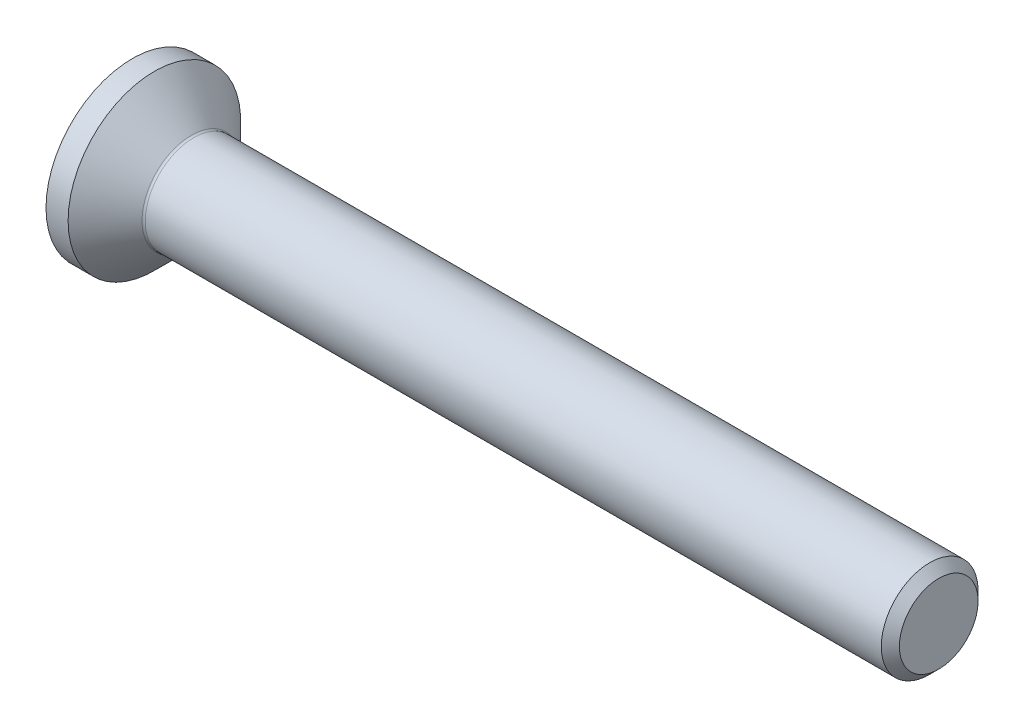
ISO-10303-21;
HEADER;
FILE_DESCRIPTION(('STEP AP214'),'2;1');
FILE_NAME('part.step','',(''),(''),'','','');
FILE_SCHEMA(('AUTOMOTIVE_DESIGN { 1 0 10303 214 1 1 1 1 }'));
ENDSEC;
DATA;
#1=APPLICATION_CONTEXT('core data for automotive mechanical design processes');
#2=APPLICATION_PROTOCOL_DEFINITION('international standard','automotive_design',2000,#1);
#3=PRODUCT_CONTEXT('',#1,'mechanical');
#4=PRODUCT('Part','Part','',(#3));
#5=PRODUCT_RELATED_PRODUCT_CATEGORY('part','',(#4));
#6=PRODUCT_DEFINITION_FORMATION('','',#4);
#7=PRODUCT_DEFINITION_CONTEXT('part definition',#1,'design');
#8=PRODUCT_DEFINITION('design','',#6,#7);
#9=PRODUCT_DEFINITION_SHAPE('','',#8);
#10=(LENGTH_UNIT() NAMED_UNIT(*) SI_UNIT(.MILLI.,.METRE.));
#11=(NAMED_UNIT(*) PLANE_ANGLE_UNIT() SI_UNIT($,.RADIAN.));
#12=(NAMED_UNIT(*) SI_UNIT($,.STERADIAN.) SOLID_ANGLE_UNIT());
#13=UNCERTAINTY_MEASURE_WITH_UNIT(LENGTH_MEASURE(1.E-05),#10,'distance_accuracy_value','');
#14=(GEOMETRIC_REPRESENTATION_CONTEXT(3) GLOBAL_UNCERTAINTY_ASSIGNED_CONTEXT((#13)) GLOBAL_UNIT_ASSIGNED_CONTEXT((#10,
#11,#12)) REPRESENTATION_CONTEXT('',''));
#15=CARTESIAN_POINT('',(0.,0.,0.));
#16=DIRECTION('',(0.,0.,1.));
#17=DIRECTION('',(1.,0.,0.));
#18=AXIS2_PLACEMENT_3D('',#15,#16,#17);
#19=CARTESIAN_POINT('',(0.,0.,0.));
#20=DIRECTION('',(-1.,0.,0.));
#21=DIRECTION('',(0.,0.,1.));
#22=AXIS2_PLACEMENT_3D('',#19,#20,#21);
#23=PLANE('',#22);
#24=CARTESIAN_POINT('',(0.,0.,0.));
#25=DIRECTION('',(-1.,0.,0.));
#26=DIRECTION('',(0.,0.,1.));
#27=AXIS2_PLACEMENT_3D('',#24,#25,#26);
#28=CIRCLE('',#27,2.675);
#29=CARTESIAN_POINT('',(0.,0.,2.675));
#30=VERTEX_POINT('',#29);
#31=EDGE_CURVE('E145',#30,#30,#28,.T.);
#32=ORIENTED_EDGE('',*,*,#31,.T.);
#33=EDGE_LOOP('',(#32));
#34=FACE_BOUND('',#33,.T.);
#35=DIRECTION('',(0.,-0.499999999999998,-0.86602540378444));
#36=VECTOR('',#35,1.);
#37=CARTESIAN_POINT('',(0.,-0.577350269189626,1.));
#38=LINE('',#37,#36);
#39=CARTESIAN_POINT('',(0.,-0.577350269189626,1.));
#40=VERTEX_POINT('',#39);
#41=CARTESIAN_POINT('',(0.,-1.15470053837925,0.));
#42=VERTEX_POINT('',#41);
#43=EDGE_CURVE('E121',#40,#42,#38,.T.);
#44=ORIENTED_EDGE('',*,*,#43,.T.);
#45=DIRECTION('',(0.,0.499999999999999,-0.866025403784439));
#46=VECTOR('',#45,1.);
#47=CARTESIAN_POINT('',(0.,-1.15470053837925,0.));
#48=LINE('',#47,#46);
#49=CARTESIAN_POINT('',(0.,-0.577350269189625,-1.));
#50=VERTEX_POINT('',#49);
#51=EDGE_CURVE('E52',#42,#50,#48,.T.);
#52=ORIENTED_EDGE('',*,*,#51,.T.);
#53=DIRECTION('',(0.,1.,0.));
#54=VECTOR('',#53,1.);
#55=CARTESIAN_POINT('',(0.,-0.577350269189625,-1.));
#56=LINE('',#55,#54);
#57=CARTESIAN_POINT('',(0.,0.577350269189626,-1.));
#58=VERTEX_POINT('',#57);
#59=EDGE_CURVE('E132',#50,#58,#56,.T.);
#60=ORIENTED_EDGE('',*,*,#59,.T.);
#61=DIRECTION('',(0.,0.5,0.866025403784439));
#62=VECTOR('',#61,1.);
#63=CARTESIAN_POINT('',(0.,0.577350269189626,-1.));
#64=LINE('',#63,#62);
#65=CARTESIAN_POINT('',(0.,1.15470053837925,0.));
#66=VERTEX_POINT('',#65);
#67=EDGE_CURVE('E380',#58,#66,#64,.T.);
#68=ORIENTED_EDGE('',*,*,#67,.T.);
#69=DIRECTION('',(0.,-0.499999999999999,0.866025403784439));
#70=VECTOR('',#69,1.);
#71=CARTESIAN_POINT('',(0.,1.15470053837925,0.));
#72=LINE('',#71,#70);
#73=CARTESIAN_POINT('',(0.,0.577350269189626,0.999999999999999));
#74=VERTEX_POINT('',#73);
#75=EDGE_CURVE('E383',#66,#74,#72,.T.);
#76=ORIENTED_EDGE('',*,*,#75,.T.);
#77=DIRECTION('',(0.,-1.,0.));
#78=VECTOR('',#77,1.);
#79=CARTESIAN_POINT('',(0.,0.577350269189626,0.999999999999999));
#80=LINE('',#79,#78);
#81=EDGE_CURVE('E386',#74,#40,#80,.T.);
#82=ORIENTED_EDGE('',*,*,#81,.T.);
#83=EDGE_LOOP('',(#44,#52,#60,#68,#76,#82));
#84=FACE_BOUND('',#83,.T.);
#85=ADVANCED_FACE('F37',(#34,#84),#23,.T.);
#86=CARTESIAN_POINT('',(25.,1.2195,0.));
#87=DIRECTION('',(1.,0.,0.));
#88=DIRECTION('',(0.,0.,-1.));
#89=AXIS2_PLACEMENT_3D('',#86,#87,#88);
#90=PLANE('',#89);
#91=CARTESIAN_POINT('',(25.,0.,0.));
#92=DIRECTION('',(-1.,0.,0.));
#93=DIRECTION('',(0.,0.,1.));
#94=AXIS2_PLACEMENT_3D('',#91,#92,#93);
#95=CIRCLE('',#94,1.2195);
#96=CARTESIAN_POINT('',(25.,0.,1.2195));
#97=VERTEX_POINT('',#96);
#98=EDGE_CURVE('E155',#97,#97,#95,.T.);
#99=ORIENTED_EDGE('',*,*,#98,.F.);
#100=EDGE_LOOP('',(#99));
#101=FACE_BOUND('',#100,.T.);
#102=ADVANCED_FACE('F175',(#101),#90,.T.);
#103=CARTESIAN_POINT('',(25.,0.,0.));
#104=DIRECTION('',(-1.,0.,0.));
#105=DIRECTION('',(0.,0.,1.));
#106=AXIS2_PLACEMENT_3D('',#103,#104,#105);
#107=CONICAL_SURFACE('',#106,1.2195,0.785398163397374);
#108=CARTESIAN_POINT('',(24.7195,0.,0.));
#109=DIRECTION('',(-1.,0.,0.));
#110=DIRECTION('',(0.,0.,1.));
#111=AXIS2_PLACEMENT_3D('',#108,#109,#110);
#112=CIRCLE('',#111,1.49999999999997);
#113=CARTESIAN_POINT('',(24.7195,0.,1.49999999999997));
#114=VERTEX_POINT('',#113);
#115=EDGE_CURVE('E152',#114,#114,#112,.T.);
#116=ORIENTED_EDGE('',*,*,#115,.F.);
#117=EDGE_LOOP('',(#116));
#118=FACE_BOUND('',#117,.T.);
#119=ORIENTED_EDGE('',*,*,#98,.T.);
#120=EDGE_LOOP('',(#119));
#121=FACE_BOUND('',#120,.T.);
#122=ADVANCED_FACE('F181',(#118,#121),#107,.T.);
#123=CARTESIAN_POINT('',(0.,0.,0.));
#124=DIRECTION('',(-1.,0.,0.));
#125=DIRECTION('',(0.,0.,1.));
#126=AXIS2_PLACEMENT_3D('',#123,#124,#125);
#127=CYLINDRICAL_SURFACE('',#126,1.49999999999999);
#128=CARTESIAN_POINT('',(1.90142135623733,0.,0.));
#129=DIRECTION('',(-1.,0.,0.));
#130=DIRECTION('',(0.,0.,1.));
#131=AXIS2_PLACEMENT_3D('',#128,#129,#130);
#132=CIRCLE('',#131,1.49999999999999);
#133=CARTESIAN_POINT('',(1.90142135623733,0.,1.49999999999999));
#134=VERTEX_POINT('',#133);
#135=EDGE_CURVE('E11',#134,#134,#132,.F.);
#136=ORIENTED_EDGE('',*,*,#135,.T.);
#137=EDGE_LOOP('',(#136));
#138=FACE_BOUND('',#137,.T.);
#139=ORIENTED_EDGE('',*,*,#115,.T.);
#140=EDGE_LOOP('',(#139));
#141=FACE_BOUND('',#140,.T.);
#142=ADVANCED_FACE('F189',(#138,#141),#127,.T.);
#143=CARTESIAN_POINT('',(0.685000000000012,0.,0.));
#144=DIRECTION('',(-1.,0.,0.));
#145=DIRECTION('',(0.,0.,1.));
#146=AXIS2_PLACEMENT_3D('',#143,#144,#145);
#147=CONICAL_SURFACE('',#146,2.675,0.785398163397451);
#148=CARTESIAN_POINT('',(1.83071067811867,0.,0.));
#149=DIRECTION('',(-1.,0.,0.));
#150=DIRECTION('',(0.,0.,1.));
#151=AXIS2_PLACEMENT_3D('',#148,#149,#150);
#152=CIRCLE('',#151,1.52928932188133);
#153=CARTESIAN_POINT('',(1.83071067811867,0.,1.52928932188133));
#154=VERTEX_POINT('',#153);
#155=EDGE_CURVE('E45',#154,#154,#152,.T.);
#156=ORIENTED_EDGE('',*,*,#155,.T.);
#157=EDGE_LOOP('',(#156));
#158=FACE_BOUND('',#157,.T.);
#159=CARTESIAN_POINT('',(0.685000000000012,0.,0.));
#160=DIRECTION('',(-1.,0.,0.));
#161=DIRECTION('',(0.,0.,1.));
#162=AXIS2_PLACEMENT_3D('',#159,#160,#161);
#163=CIRCLE('',#162,2.675);
#164=CARTESIAN_POINT('',(0.685000000000012,0.,2.675));
#165=VERTEX_POINT('',#164);
#166=EDGE_CURVE('E149',#165,#165,#163,.T.);
#167=ORIENTED_EDGE('',*,*,#166,.F.);
#168=EDGE_LOOP('',(#167));
#169=FACE_BOUND('',#168,.T.);
#170=ADVANCED_FACE('F160',(#158,#169),#147,.T.);
#171=CARTESIAN_POINT('',(0.,0.,0.));
#172=DIRECTION('',(-1.,0.,0.));
#173=DIRECTION('',(0.,0.,1.));
#174=AXIS2_PLACEMENT_3D('',#171,#172,#173);
#175=CYLINDRICAL_SURFACE('',#174,2.675);
#176=ORIENTED_EDGE('',*,*,#166,.T.);
#177=EDGE_LOOP('',(#176));
#178=FACE_BOUND('',#177,.T.);
#179=ORIENTED_EDGE('',*,*,#31,.F.);
#180=EDGE_LOOP('',(#179));
#181=FACE_BOUND('',#180,.T.);
#182=ADVANCED_FACE('F164',(#178,#181),#175,.T.);
#183=CARTESIAN_POINT('',(1.90142135623733,0.,0.));
#184=DIRECTION('',(-1.,0.,0.));
#185=DIRECTION('',(0.,0.,1.));
#186=AXIS2_PLACEMENT_3D('',#183,#184,#185);
#187=TOROIDAL_SURFACE('',#186,1.59999999999999,0.1);
#188=ORIENTED_EDGE('',*,*,#135,.F.);
#189=EDGE_LOOP('',(#188));
#190=FACE_BOUND('',#189,.T.);
#191=ORIENTED_EDGE('',*,*,#155,.F.);
#192=EDGE_LOOP('',(#191));
#193=FACE_BOUND('',#192,.T.);
#194=ADVANCED_FACE('F39',(#190,#193),#187,.F.);
#195=CARTESIAN_POINT('',(1.1,-1.15470053837925,0.));
#196=DIRECTION('',(0.,0.866025403784439,0.499999999999999));
#197=DIRECTION('',(0.,-0.499999999999999,0.866025403784439));
#198=AXIS2_PLACEMENT_3D('',#195,#196,#197);
#199=PLANE('',#198);
#200=ORIENTED_EDGE('',*,*,#51,.F.);
#201=DIRECTION('',(-1.,0.,0.));
#202=VECTOR('',#201,1.);
#203=CARTESIAN_POINT('',(1.1,-1.15470053837925,0.));
#204=LINE('',#203,#202);
#205=CARTESIAN_POINT('',(1.1,-1.15470053837925,0.));
#206=VERTEX_POINT('',#205);
#207=EDGE_CURVE('E377',#206,#42,#204,.T.);
#208=ORIENTED_EDGE('',*,*,#207,.F.);
#209=DIRECTION('',(0.,0.499999999999999,-0.866025403784439));
#210=VECTOR('',#209,1.);
#211=CARTESIAN_POINT('',(1.1,-1.15470053837925,0.));
#212=LINE('',#211,#210);
#213=CARTESIAN_POINT('',(1.1,-0.866025403784438,-0.499999999999998));
#214=VERTEX_POINT('',#213);
#215=EDGE_CURVE('E117',#206,#214,#212,.T.);
#216=ORIENTED_EDGE('',*,*,#215,.T.);
#217=CARTESIAN_POINT('',(1.1,-0.577350269189625,-1.));
#218=VERTEX_POINT('',#217);
#219=EDGE_CURVE('E113',#214,#218,#212,.T.);
#220=ORIENTED_EDGE('',*,*,#219,.T.);
#221=DIRECTION('',(-1.,0.,0.));
#222=VECTOR('',#221,1.);
#223=CARTESIAN_POINT('',(1.1,-0.577350269189625,-1.));
#224=LINE('',#223,#222);
#225=EDGE_CURVE('E115',#218,#50,#224,.T.);
#226=ORIENTED_EDGE('',*,*,#225,.T.);
#227=EDGE_LOOP('',(#200,#208,#216,#220,#226));
#228=FACE_BOUND('',#227,.T.);
#229=ADVANCED_FACE('F114',(#228),#199,.T.);
#230=CARTESIAN_POINT('',(1.1,-0.577350269189625,-1.));
#231=DIRECTION('',(0.,0.,1.));
#232=DIRECTION('',(1.,0.,0.));
#233=AXIS2_PLACEMENT_3D('',#230,#231,#232);
#234=PLANE('',#233);
#235=ORIENTED_EDGE('',*,*,#59,.F.);
#236=ORIENTED_EDGE('',*,*,#225,.F.);
#237=DIRECTION('',(0.,1.,0.));
#238=VECTOR('',#237,1.);
#239=CARTESIAN_POINT('',(1.1,-0.577350269189625,-1.));
#240=LINE('',#239,#238);
#241=CARTESIAN_POINT('',(1.1,0.,-1.));
#242=VERTEX_POINT('',#241);
#243=EDGE_CURVE('E60',#218,#242,#240,.T.);
#244=ORIENTED_EDGE('',*,*,#243,.T.);
#245=CARTESIAN_POINT('',(1.1,0.577350269189626,-1.));
#246=VERTEX_POINT('',#245);
#247=EDGE_CURVE('E127',#242,#246,#240,.T.);
#248=ORIENTED_EDGE('',*,*,#247,.T.);
#249=DIRECTION('',(-1.,0.,0.));
#250=VECTOR('',#249,1.);
#251=CARTESIAN_POINT('',(1.1,0.577350269189626,-1.));
#252=LINE('',#251,#250);
#253=EDGE_CURVE('E134',#246,#58,#252,.T.);
#254=ORIENTED_EDGE('',*,*,#253,.T.);
#255=EDGE_LOOP('',(#235,#236,#244,#248,#254));
#256=FACE_BOUND('',#255,.T.);
#257=ADVANCED_FACE('F129',(#256),#234,.T.);
#258=CARTESIAN_POINT('',(1.1,0.577350269189626,-1.));
#259=DIRECTION('',(0.,-0.866025403784438,0.5));
#260=DIRECTION('',(0.,-0.5,-0.866025403784439));
#261=AXIS2_PLACEMENT_3D('',#258,#259,#260);
#262=PLANE('',#261);
#263=ORIENTED_EDGE('',*,*,#67,.F.);
#264=ORIENTED_EDGE('',*,*,#253,.F.);
#265=DIRECTION('',(0.,0.5,0.866025403784439));
#266=VECTOR('',#265,1.);
#267=CARTESIAN_POINT('',(1.1,0.577350269189626,-1.));
#268=LINE('',#267,#266);
#269=CARTESIAN_POINT('',(1.1,0.866025403784439,-0.5));
#270=VERTEX_POINT('',#269);
#271=EDGE_CURVE('E358',#246,#270,#268,.T.);
#272=ORIENTED_EDGE('',*,*,#271,.T.);
#273=CARTESIAN_POINT('',(1.1,1.15470053837925,0.));
#274=VERTEX_POINT('',#273);
#275=EDGE_CURVE('E126',#270,#274,#268,.T.);
#276=ORIENTED_EDGE('',*,*,#275,.T.);
#277=DIRECTION('',(-1.,0.,0.));
#278=VECTOR('',#277,1.);
#279=CARTESIAN_POINT('',(1.1,1.15470053837925,0.));
#280=LINE('',#279,#278);
#281=EDGE_CURVE('E140',#274,#66,#280,.T.);
#282=ORIENTED_EDGE('',*,*,#281,.T.);
#283=EDGE_LOOP('',(#263,#264,#272,#276,#282));
#284=FACE_BOUND('',#283,.T.);
#285=ADVANCED_FACE('F261',(#284),#262,.T.);
#286=CARTESIAN_POINT('',(1.1,1.15470053837925,0.));
#287=DIRECTION('',(0.,-0.866025403784439,-0.499999999999999));
#288=DIRECTION('',(0.,0.499999999999999,-0.866025403784439));
#289=AXIS2_PLACEMENT_3D('',#286,#287,#288);
#290=PLANE('',#289);
#291=ORIENTED_EDGE('',*,*,#75,.F.);
#292=ORIENTED_EDGE('',*,*,#281,.F.);
#293=DIRECTION('',(0.,-0.499999999999999,0.866025403784439));
#294=VECTOR('',#293,1.);
#295=CARTESIAN_POINT('',(1.1,1.15470053837925,0.));
#296=LINE('',#295,#294);
#297=CARTESIAN_POINT('',(1.1,0.866025403784438,0.499999999999999));
#298=VERTEX_POINT('',#297);
#299=EDGE_CURVE('E365',#274,#298,#296,.T.);
#300=ORIENTED_EDGE('',*,*,#299,.T.);
#301=CARTESIAN_POINT('',(1.1,0.577350269189626,0.999999999999999));
#302=VERTEX_POINT('',#301);
#303=EDGE_CURVE('E363',#298,#302,#296,.T.);
#304=ORIENTED_EDGE('',*,*,#303,.T.);
#305=DIRECTION('',(-1.,0.,0.));
#306=VECTOR('',#305,1.);
#307=CARTESIAN_POINT('',(1.1,0.577350269189626,0.999999999999999));
#308=LINE('',#307,#306);
#309=EDGE_CURVE('E395',#302,#74,#308,.T.);
#310=ORIENTED_EDGE('',*,*,#309,.T.);
#311=EDGE_LOOP('',(#291,#292,#300,#304,#310));
#312=FACE_BOUND('',#311,.T.);
#313=ADVANCED_FACE('F269',(#312),#290,.T.);
#314=CARTESIAN_POINT('',(1.1,0.577350269189626,0.999999999999999));
#315=DIRECTION('',(0.,0.,-1.));
#316=DIRECTION('',(0.,1.,0.));
#317=AXIS2_PLACEMENT_3D('',#314,#315,#316);
#318=PLANE('',#317);
#319=ORIENTED_EDGE('',*,*,#81,.F.);
#320=ORIENTED_EDGE('',*,*,#309,.F.);
#321=DIRECTION('',(0.,-1.,0.));
#322=VECTOR('',#321,1.);
#323=CARTESIAN_POINT('',(1.1,0.577350269189626,0.999999999999999));
#324=LINE('',#323,#322);
#325=CARTESIAN_POINT('',(1.1,0.,1.));
#326=VERTEX_POINT('',#325);
#327=EDGE_CURVE('E370',#302,#326,#324,.T.);
#328=ORIENTED_EDGE('',*,*,#327,.T.);
#329=CARTESIAN_POINT('',(1.1,-0.577350269189626,1.));
#330=VERTEX_POINT('',#329);
#331=EDGE_CURVE('E369',#326,#330,#324,.T.);
#332=ORIENTED_EDGE('',*,*,#331,.T.);
#333=DIRECTION('',(-1.,0.,0.));
#334=VECTOR('',#333,1.);
#335=CARTESIAN_POINT('',(1.1,-0.577350269189626,1.));
#336=LINE('',#335,#334);
#337=EDGE_CURVE('E392',#330,#40,#336,.T.);
#338=ORIENTED_EDGE('',*,*,#337,.T.);
#339=EDGE_LOOP('',(#319,#320,#328,#332,#338));
#340=FACE_BOUND('',#339,.T.);
#341=ADVANCED_FACE('F278',(#340),#318,.T.);
#342=CARTESIAN_POINT('',(1.1,-0.577350269189626,1.));
#343=DIRECTION('',(0.,0.86602540378444,-0.499999999999998));
#344=DIRECTION('',(0.,0.499999999999998,0.86602540378444));
#345=AXIS2_PLACEMENT_3D('',#342,#343,#344);
#346=PLANE('',#345);
#347=ORIENTED_EDGE('',*,*,#43,.F.);
#348=ORIENTED_EDGE('',*,*,#337,.F.);
#349=DIRECTION('',(0.,-0.499999999999998,-0.86602540378444));
#350=VECTOR('',#349,1.);
#351=CARTESIAN_POINT('',(1.1,-0.577350269189626,1.));
#352=LINE('',#351,#350);
#353=CARTESIAN_POINT('',(1.1,-0.866025403784439,0.499999999999997));
#354=VERTEX_POINT('',#353);
#355=EDGE_CURVE('E374',#330,#354,#352,.T.);
#356=ORIENTED_EDGE('',*,*,#355,.T.);
#357=EDGE_CURVE('E373',#354,#206,#352,.T.);
#358=ORIENTED_EDGE('',*,*,#357,.T.);
#359=ORIENTED_EDGE('',*,*,#207,.T.);
#360=EDGE_LOOP('',(#347,#348,#356,#358,#359));
#361=FACE_BOUND('',#360,.T.);
#362=ADVANCED_FACE('F287',(#361),#346,.T.);
#363=CARTESIAN_POINT('',(1.1,-0.577350269189626,-1.));
#364=DIRECTION('',(1.,0.,0.));
#365=DIRECTION('',(0.,0.,-1.));
#366=AXIS2_PLACEMENT_3D('',#363,#364,#365);
#367=PLANE('',#366);
#368=ORIENTED_EDGE('',*,*,#243,.F.);
#369=ORIENTED_EDGE('',*,*,#219,.F.);
#370=CARTESIAN_POINT('',(1.1,0.,0.));
#371=DIRECTION('',(-1.,0.,0.));
#372=DIRECTION('',(0.,0.,1.));
#373=AXIS2_PLACEMENT_3D('',#370,#371,#372);
#374=CIRCLE('',#373,1.);
#375=EDGE_CURVE('E124',#242,#214,#374,.T.);
#376=ORIENTED_EDGE('',*,*,#375,.F.);
#377=EDGE_LOOP('',(#368,#369,#376));
#378=FACE_BOUND('',#377,.T.);
#379=ADVANCED_FACE('F123',(#378),#367,.F.);
#380=ORIENTED_EDGE('',*,*,#215,.F.);
#381=ORIENTED_EDGE('',*,*,#357,.F.);
#382=EDGE_CURVE('E137',#214,#354,#374,.T.);
#383=ORIENTED_EDGE('',*,*,#382,.F.);
#384=EDGE_LOOP('',(#380,#381,#383));
#385=FACE_BOUND('',#384,.T.);
#386=ADVANCED_FACE('F304',(#385),#367,.F.);
#387=ORIENTED_EDGE('',*,*,#355,.F.);
#388=ORIENTED_EDGE('',*,*,#331,.F.);
#389=EDGE_CURVE('E133',#354,#326,#374,.T.);
#390=ORIENTED_EDGE('',*,*,#389,.F.);
#391=EDGE_LOOP('',(#387,#388,#390));
#392=FACE_BOUND('',#391,.T.);
#393=ADVANCED_FACE('F312',(#392),#367,.F.);
#394=ORIENTED_EDGE('',*,*,#327,.F.);
#395=ORIENTED_EDGE('',*,*,#303,.F.);
#396=EDGE_CURVE('E139',#326,#298,#374,.T.);
#397=ORIENTED_EDGE('',*,*,#396,.F.);
#398=EDGE_LOOP('',(#394,#395,#397));
#399=FACE_BOUND('',#398,.T.);
#400=ADVANCED_FACE('F320',(#399),#367,.F.);
#401=ORIENTED_EDGE('',*,*,#299,.F.);
#402=ORIENTED_EDGE('',*,*,#275,.F.);
#403=EDGE_CURVE('E146',#298,#270,#374,.T.);
#404=ORIENTED_EDGE('',*,*,#403,.F.);
#405=EDGE_LOOP('',(#401,#402,#404));
#406=FACE_BOUND('',#405,.T.);
#407=ADVANCED_FACE('F328',(#406),#367,.F.);
#408=ORIENTED_EDGE('',*,*,#271,.F.);
#409=ORIENTED_EDGE('',*,*,#247,.F.);
#410=EDGE_CURVE('E359',#270,#242,#374,.T.);
#411=ORIENTED_EDGE('',*,*,#410,.F.);
#412=EDGE_LOOP('',(#408,#409,#411));
#413=FACE_BOUND('',#412,.T.);
#414=ADVANCED_FACE('F243',(#413),#367,.F.);
#415=CARTESIAN_POINT('',(1.1,0.,0.));
#416=DIRECTION('',(-1.,0.,0.));
#417=DIRECTION('',(0.,0.,1.));
#418=AXIS2_PLACEMENT_3D('',#415,#416,#417);
#419=CONICAL_SURFACE('',#418,1.,1.04719755119659);
#420=CARTESIAN_POINT('',(1.67735026918963,0.,0.));
#421=VERTEX_POINT('',#420);
#422=VERTEX_LOOP('',#421);
#423=FACE_BOUND('',#422,.T.);
#424=ORIENTED_EDGE('',*,*,#396,.T.);
#425=ORIENTED_EDGE('',*,*,#403,.T.);
#426=ORIENTED_EDGE('',*,*,#410,.T.);
#427=ORIENTED_EDGE('',*,*,#375,.T.);
#428=ORIENTED_EDGE('',*,*,#382,.T.);
#429=ORIENTED_EDGE('',*,*,#389,.T.);
#430=EDGE_LOOP('',(#424,#425,#426,#427,#428,#429));
#431=FACE_BOUND('',#430,.T.);
#432=ADVANCED_FACE('F185',(#423,#431),#419,.F.);
#433=CLOSED_SHELL('',(#85,#102,#122,#142,#170,#182,#194,#229,#257,#285,#313,#341,#362,#379,#386,
#393,#400,#407,#414,#432));
#434=MANIFOLD_SOLID_BREP('B2',#433);
#435=ADVANCED_BREP_SHAPE_REPRESENTATION('',(#18,#434),#14);
#436=SHAPE_DEFINITION_REPRESENTATION(#9,#435);
ENDSEC;
END-ISO-10303-21;
